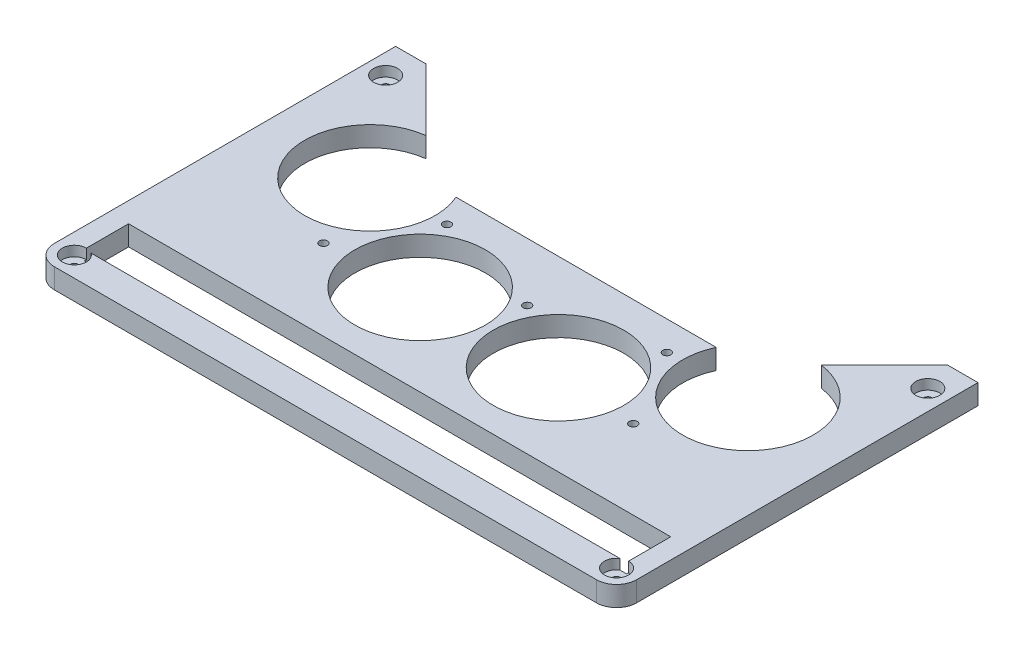
ISO-10303-21;
HEADER;
FILE_DESCRIPTION(('STEP AP214'),'2;1');
FILE_NAME('part.step','',(''),(''),'','','');
FILE_SCHEMA(('AUTOMOTIVE_DESIGN { 1 0 10303 214 1 1 1 1 }'));
ENDSEC;
DATA;
#1=APPLICATION_CONTEXT('core data for automotive mechanical design processes');
#2=APPLICATION_PROTOCOL_DEFINITION('international standard','automotive_design',2000,#1);
#3=PRODUCT_CONTEXT('',#1,'mechanical');
#4=PRODUCT('Part','Part','',(#3));
#5=PRODUCT_RELATED_PRODUCT_CATEGORY('part','',(#4));
#6=PRODUCT_DEFINITION_FORMATION('','',#4);
#7=PRODUCT_DEFINITION_CONTEXT('part definition',#1,'design');
#8=PRODUCT_DEFINITION('design','',#6,#7);
#9=PRODUCT_DEFINITION_SHAPE('','',#8);
#10=(LENGTH_UNIT() NAMED_UNIT(*) SI_UNIT(.MILLI.,.METRE.));
#11=(NAMED_UNIT(*) PLANE_ANGLE_UNIT() SI_UNIT($,.RADIAN.));
#12=(NAMED_UNIT(*) SI_UNIT($,.STERADIAN.) SOLID_ANGLE_UNIT());
#13=UNCERTAINTY_MEASURE_WITH_UNIT(LENGTH_MEASURE(1.E-05),#10,'distance_accuracy_value','');
#14=(GEOMETRIC_REPRESENTATION_CONTEXT(3) GLOBAL_UNCERTAINTY_ASSIGNED_CONTEXT((#13)) GLOBAL_UNIT_ASSIGNED_CONTEXT((#10,
#11,#12)) REPRESENTATION_CONTEXT('',''));
#15=CARTESIAN_POINT('',(0.,0.,0.));
#16=DIRECTION('',(0.,0.,1.));
#17=DIRECTION('',(1.,0.,0.));
#18=AXIS2_PLACEMENT_3D('',#15,#16,#17);
#19=CARTESIAN_POINT('',(10.,0.,-10.));
#20=DIRECTION('',(0.,1.,0.));
#21=DIRECTION('',(0.,0.,1.));
#22=AXIS2_PLACEMENT_3D('',#19,#20,#21);
#23=CYLINDRICAL_SURFACE('',#22,2.);
#24=CARTESIAN_POINT('',(10.,0.,-10.));
#25=DIRECTION('',(0.,1.,0.));
#26=DIRECTION('',(0.,0.,1.));
#27=AXIS2_PLACEMENT_3D('',#24,#25,#26);
#28=CIRCLE('',#27,2.);
#29=CARTESIAN_POINT('',(10.,0.,-8.));
#30=VERTEX_POINT('',#29);
#31=EDGE_CURVE('E281',#30,#30,#28,.T.);
#32=ORIENTED_EDGE('',*,*,#31,.F.);
#33=EDGE_LOOP('',(#32));
#34=FACE_BOUND('',#33,.T.);
#35=CARTESIAN_POINT('',(10.,5.,-10.));
#36=DIRECTION('',(0.,1.,0.));
#37=DIRECTION('',(0.,0.,1.));
#38=AXIS2_PLACEMENT_3D('',#35,#36,#37);
#39=CIRCLE('',#38,2.);
#40=CARTESIAN_POINT('',(10.,5.,-8.));
#41=VERTEX_POINT('',#40);
#42=EDGE_CURVE('E375',#41,#41,#39,.F.);
#43=ORIENTED_EDGE('',*,*,#42,.F.);
#44=EDGE_LOOP('',(#43));
#45=FACE_BOUND('',#44,.T.);
#46=ADVANCED_FACE('F33',(#34,#45),#23,.F.);
#47=CARTESIAN_POINT('',(280.,0.,-10.));
#48=DIRECTION('',(0.,1.,0.));
#49=DIRECTION('',(0.,0.,1.));
#50=AXIS2_PLACEMENT_3D('',#47,#48,#49);
#51=CYLINDRICAL_SURFACE('',#50,2.);
#52=CARTESIAN_POINT('',(280.,0.,-10.));
#53=DIRECTION('',(0.,1.,0.));
#54=DIRECTION('',(0.,0.,-1.));
#55=AXIS2_PLACEMENT_3D('',#52,#53,#54);
#56=CIRCLE('',#55,2.);
#57=CARTESIAN_POINT('',(280.,0.,-12.));
#58=VERTEX_POINT('',#57);
#59=EDGE_CURVE('E278',#58,#58,#56,.T.);
#60=ORIENTED_EDGE('',*,*,#59,.F.);
#61=EDGE_LOOP('',(#60));
#62=FACE_BOUND('',#61,.T.);
#63=CARTESIAN_POINT('',(280.,5.,-10.));
#64=DIRECTION('',(0.,1.,0.));
#65=DIRECTION('',(0.,0.,1.));
#66=AXIS2_PLACEMENT_3D('',#63,#64,#65);
#67=CIRCLE('',#66,2.);
#68=CARTESIAN_POINT('',(280.,5.,-8.));
#69=VERTEX_POINT('',#68);
#70=EDGE_CURVE('E729',#69,#69,#67,.F.);
#71=ORIENTED_EDGE('',*,*,#70,.F.);
#72=EDGE_LOOP('',(#71));
#73=FACE_BOUND('',#72,.T.);
#74=ADVANCED_FACE('F410',(#62,#73),#51,.F.);
#75=CARTESIAN_POINT('',(280.,0.,-165.));
#76=DIRECTION('',(0.,1.,0.));
#77=DIRECTION('',(0.,0.,1.));
#78=AXIS2_PLACEMENT_3D('',#75,#76,#77);
#79=CYLINDRICAL_SURFACE('',#78,2.);
#80=CARTESIAN_POINT('',(280.,0.,-165.));
#81=DIRECTION('',(0.,1.,0.));
#82=DIRECTION('',(0.,0.,-1.));
#83=AXIS2_PLACEMENT_3D('',#80,#81,#82);
#84=CIRCLE('',#83,2.);
#85=CARTESIAN_POINT('',(280.,0.,-167.));
#86=VERTEX_POINT('',#85);
#87=EDGE_CURVE('E358',#86,#86,#84,.T.);
#88=ORIENTED_EDGE('',*,*,#87,.F.);
#89=EDGE_LOOP('',(#88));
#90=FACE_BOUND('',#89,.T.);
#91=CARTESIAN_POINT('',(280.,5.,-165.));
#92=DIRECTION('',(0.,1.,0.));
#93=DIRECTION('',(0.,0.,1.));
#94=AXIS2_PLACEMENT_3D('',#91,#92,#93);
#95=CIRCLE('',#94,2.);
#96=CARTESIAN_POINT('',(280.,5.,-163.));
#97=VERTEX_POINT('',#96);
#98=EDGE_CURVE('E360',#97,#97,#95,.F.);
#99=ORIENTED_EDGE('',*,*,#98,.F.);
#100=EDGE_LOOP('',(#99));
#101=FACE_BOUND('',#100,.T.);
#102=ADVANCED_FACE('F416',(#90,#101),#79,.F.);
#103=CARTESIAN_POINT('',(10.,0.,-165.));
#104=DIRECTION('',(0.,1.,0.));
#105=DIRECTION('',(0.,0.,1.));
#106=AXIS2_PLACEMENT_3D('',#103,#104,#105);
#107=CYLINDRICAL_SURFACE('',#106,2.);
#108=CARTESIAN_POINT('',(10.,0.,-165.));
#109=DIRECTION('',(0.,1.,0.));
#110=DIRECTION('',(0.,0.,1.));
#111=AXIS2_PLACEMENT_3D('',#108,#109,#110);
#112=CIRCLE('',#111,2.);
#113=CARTESIAN_POINT('',(10.,0.,-163.));
#114=VERTEX_POINT('',#113);
#115=EDGE_CURVE('E196',#114,#114,#112,.T.);
#116=ORIENTED_EDGE('',*,*,#115,.F.);
#117=EDGE_LOOP('',(#116));
#118=FACE_BOUND('',#117,.T.);
#119=CARTESIAN_POINT('',(10.,5.,-165.));
#120=DIRECTION('',(0.,1.,0.));
#121=DIRECTION('',(0.,0.,1.));
#122=AXIS2_PLACEMENT_3D('',#119,#120,#121);
#123=CIRCLE('',#122,2.);
#124=CARTESIAN_POINT('',(10.,5.,-163.));
#125=VERTEX_POINT('',#124);
#126=EDGE_CURVE('E355',#125,#125,#123,.F.);
#127=ORIENTED_EDGE('',*,*,#126,.F.);
#128=EDGE_LOOP('',(#127));
#129=FACE_BOUND('',#128,.T.);
#130=ADVANCED_FACE('F460',(#118,#129),#107,.F.);
#131=CARTESIAN_POINT('',(0.,10.,0.));
#132=DIRECTION('',(1.,0.,0.));
#133=DIRECTION('',(0.,0.,-1.));
#134=AXIS2_PLACEMENT_3D('',#131,#132,#133);
#135=PLANE('',#134);
#136=DIRECTION('',(0.,0.,1.));
#137=VECTOR('',#136,1.);
#138=CARTESIAN_POINT('',(0.,0.,0.));
#139=LINE('',#138,#137);
#140=CARTESIAN_POINT('',(0.,0.,-180.));
#141=VERTEX_POINT('',#140);
#142=CARTESIAN_POINT('',(0.,0.,-10.));
#143=VERTEX_POINT('',#142);
#144=EDGE_CURVE('E284',#141,#143,#139,.T.);
#145=ORIENTED_EDGE('',*,*,#144,.T.);
#146=DIRECTION('',(0.,-1.,0.));
#147=VECTOR('',#146,1.);
#148=CARTESIAN_POINT('',(0.,10.,-10.));
#149=LINE('',#148,#147);
#150=CARTESIAN_POINT('',(0.,10.,-10.));
#151=VERTEX_POINT('',#150);
#152=EDGE_CURVE('E345',#143,#151,#149,.F.);
#153=ORIENTED_EDGE('',*,*,#152,.T.);
#154=DIRECTION('',(0.,0.,1.));
#155=VECTOR('',#154,1.);
#156=CARTESIAN_POINT('',(0.,10.,0.));
#157=LINE('',#156,#155);
#158=CARTESIAN_POINT('',(0.,10.,-180.));
#159=VERTEX_POINT('',#158);
#160=EDGE_CURVE('E285',#159,#151,#157,.T.);
#161=ORIENTED_EDGE('',*,*,#160,.F.);
#162=DIRECTION('',(0.,-1.,0.));
#163=VECTOR('',#162,1.);
#164=CARTESIAN_POINT('',(0.,10.,-180.));
#165=LINE('',#164,#163);
#166=EDGE_CURVE('E306',#159,#141,#165,.T.);
#167=ORIENTED_EDGE('',*,*,#166,.T.);
#168=EDGE_LOOP('',(#145,#153,#161,#167));
#169=FACE_BOUND('',#168,.T.);
#170=ADVANCED_FACE('F457',(#169),#135,.F.);
#171=CARTESIAN_POINT('',(0.,10.,0.));
#172=DIRECTION('',(0.,0.,-1.));
#173=DIRECTION('',(-1.,0.,0.));
#174=AXIS2_PLACEMENT_3D('',#171,#172,#173);
#175=PLANE('',#174);
#176=DIRECTION('',(1.,0.,0.));
#177=VECTOR('',#176,1.);
#178=CARTESIAN_POINT('',(0.,10.,0.));
#179=LINE('',#178,#177);
#180=CARTESIAN_POINT('',(10.,10.,0.));
#181=VERTEX_POINT('',#180);
#182=CARTESIAN_POINT('',(280.,10.,0.));
#183=VERTEX_POINT('',#182);
#184=EDGE_CURVE('E288',#181,#183,#179,.T.);
#185=ORIENTED_EDGE('',*,*,#184,.F.);
#186=DIRECTION('',(0.,-1.,0.));
#187=VECTOR('',#186,1.);
#188=CARTESIAN_POINT('',(10.,10.,0.));
#189=LINE('',#188,#187);
#190=CARTESIAN_POINT('',(10.,0.,0.));
#191=VERTEX_POINT('',#190);
#192=EDGE_CURVE('E338',#181,#191,#189,.T.);
#193=ORIENTED_EDGE('',*,*,#192,.T.);
#194=DIRECTION('',(1.,0.,0.));
#195=VECTOR('',#194,1.);
#196=CARTESIAN_POINT('',(0.,0.,0.));
#197=LINE('',#196,#195);
#198=CARTESIAN_POINT('',(280.,0.,0.));
#199=VERTEX_POINT('',#198);
#200=EDGE_CURVE('E309',#191,#199,#197,.T.);
#201=ORIENTED_EDGE('',*,*,#200,.T.);
#202=DIRECTION('',(0.,-1.,0.));
#203=VECTOR('',#202,1.);
#204=CARTESIAN_POINT('',(280.,10.,0.));
#205=LINE('',#204,#203);
#206=EDGE_CURVE('E336',#199,#183,#205,.F.);
#207=ORIENTED_EDGE('',*,*,#206,.T.);
#208=EDGE_LOOP('',(#185,#193,#201,#207));
#209=FACE_BOUND('',#208,.T.);
#210=ADVANCED_FACE('F453',(#209),#175,.F.);
#211=CARTESIAN_POINT('',(290.,10.,0.));
#212=DIRECTION('',(-1.,0.,0.));
#213=DIRECTION('',(0.,0.,1.));
#214=AXIS2_PLACEMENT_3D('',#211,#212,#213);
#215=PLANE('',#214);
#216=DIRECTION('',(0.,0.,-1.));
#217=VECTOR('',#216,1.);
#218=CARTESIAN_POINT('',(290.,10.,0.));
#219=LINE('',#218,#217);
#220=CARTESIAN_POINT('',(290.,10.,-10.));
#221=VERTEX_POINT('',#220);
#222=CARTESIAN_POINT('',(290.,10.,-180.));
#223=VERTEX_POINT('',#222);
#224=EDGE_CURVE('E292',#221,#223,#219,.T.);
#225=ORIENTED_EDGE('',*,*,#224,.F.);
#226=DIRECTION('',(0.,-1.,0.));
#227=VECTOR('',#226,1.);
#228=CARTESIAN_POINT('',(290.,10.,-10.));
#229=LINE('',#228,#227);
#230=CARTESIAN_POINT('',(290.,0.,-10.));
#231=VERTEX_POINT('',#230);
#232=EDGE_CURVE('E351',#221,#231,#229,.T.);
#233=ORIENTED_EDGE('',*,*,#232,.T.);
#234=DIRECTION('',(0.,0.,-1.));
#235=VECTOR('',#234,1.);
#236=CARTESIAN_POINT('',(290.,0.,0.));
#237=LINE('',#236,#235);
#238=CARTESIAN_POINT('',(290.,0.,-180.));
#239=VERTEX_POINT('',#238);
#240=EDGE_CURVE('E312',#231,#239,#237,.T.);
#241=ORIENTED_EDGE('',*,*,#240,.T.);
#242=DIRECTION('',(0.,-1.,0.));
#243=VECTOR('',#242,1.);
#244=CARTESIAN_POINT('',(290.,10.,-180.));
#245=LINE('',#244,#243);
#246=EDGE_CURVE('E333',#223,#239,#245,.T.);
#247=ORIENTED_EDGE('',*,*,#246,.F.);
#248=EDGE_LOOP('',(#225,#233,#241,#247));
#249=FACE_BOUND('',#248,.T.);
#250=ADVANCED_FACE('F449',(#249),#215,.F.);
#251=CARTESIAN_POINT('',(290.,10.,-180.));
#252=DIRECTION('',(0.,0.,1.));
#253=DIRECTION('',(1.,0.,0.));
#254=AXIS2_PLACEMENT_3D('',#251,#252,#253);
#255=PLANE('',#254);
#256=DIRECTION('',(-1.,0.,0.));
#257=VECTOR('',#256,1.);
#258=CARTESIAN_POINT('',(290.,0.,-180.));
#259=LINE('',#258,#257);
#260=CARTESIAN_POINT('',(275.,0.,-180.));
#261=VERTEX_POINT('',#260);
#262=EDGE_CURVE('E314',#239,#261,#259,.T.);
#263=ORIENTED_EDGE('',*,*,#262,.T.);
#264=DIRECTION('',(0.,-1.,0.));
#265=VECTOR('',#264,1.);
#266=CARTESIAN_POINT('',(275.,10.,-180.));
#267=LINE('',#266,#265);
#268=CARTESIAN_POINT('',(275.,10.,-180.));
#269=VERTEX_POINT('',#268);
#270=EDGE_CURVE('E330',#269,#261,#267,.T.);
#271=ORIENTED_EDGE('',*,*,#270,.F.);
#272=DIRECTION('',(-1.,0.,0.));
#273=VECTOR('',#272,1.);
#274=CARTESIAN_POINT('',(290.,10.,-180.));
#275=LINE('',#274,#273);
#276=EDGE_CURVE('E294',#223,#269,#275,.T.);
#277=ORIENTED_EDGE('',*,*,#276,.F.);
#278=ORIENTED_EDGE('',*,*,#246,.T.);
#279=EDGE_LOOP('',(#263,#271,#277,#278));
#280=FACE_BOUND('',#279,.T.);
#281=ADVANCED_FACE('F445',(#280),#255,.F.);
#282=CARTESIAN_POINT('',(275.,10.,-180.));
#283=DIRECTION('',(0.707106781186549,0.,0.707106781186546));
#284=DIRECTION('',(0.707106781186546,0.,-0.707106781186549));
#285=AXIS2_PLACEMENT_3D('',#282,#283,#284);
#286=PLANE('',#285);
#287=DIRECTION('',(-0.707106781186546,0.,0.707106781186549));
#288=VECTOR('',#287,1.);
#289=CARTESIAN_POINT('',(275.,0.,-180.));
#290=LINE('',#289,#288);
#291=CARTESIAN_POINT('',(243.509947245319,0.,-148.509947245319));
#292=VERTEX_POINT('',#291);
#293=EDGE_CURVE('E316',#261,#292,#290,.T.);
#294=ORIENTED_EDGE('',*,*,#293,.T.);
#295=DIRECTION('',(0.,-1.,0.));
#296=VECTOR('',#295,1.);
#297=CARTESIAN_POINT('',(243.509947245319,10.,-148.509947245319));
#298=LINE('',#297,#296);
#299=CARTESIAN_POINT('',(243.509947245319,10.,-148.509947245319));
#300=VERTEX_POINT('',#299);
#301=EDGE_CURVE('E275',#292,#300,#298,.F.);
#302=ORIENTED_EDGE('',*,*,#301,.T.);
#303=DIRECTION('',(-0.707106781186546,0.,0.707106781186549));
#304=VECTOR('',#303,1.);
#305=CARTESIAN_POINT('',(275.,10.,-180.));
#306=LINE('',#305,#304);
#307=EDGE_CURVE('E296',#269,#300,#306,.T.);
#308=ORIENTED_EDGE('',*,*,#307,.F.);
#309=ORIENTED_EDGE('',*,*,#270,.T.);
#310=EDGE_LOOP('',(#294,#302,#308,#309));
#311=FACE_BOUND('',#310,.T.);
#312=ADVANCED_FACE('F441',(#311),#286,.F.);
#313=CARTESIAN_POINT('',(64.9999999999998,10.,-130.));
#314=DIRECTION('',(0.,0.,1.));
#315=DIRECTION('',(1.,0.,0.));
#316=AXIS2_PLACEMENT_3D('',#313,#314,#315);
#317=PLANE('',#316);
#318=DIRECTION('',(-1.,0.,0.));
#319=VECTOR('',#318,1.);
#320=CARTESIAN_POINT('',(64.9999999999998,0.,-130.));
#321=LINE('',#320,#319);
#322=CARTESIAN_POINT('',(209.63044313344,0.,-130.));
#323=VERTEX_POINT('',#322);
#324=CARTESIAN_POINT('',(80.0498040437955,0.,-130.));
#325=VERTEX_POINT('',#324);
#326=EDGE_CURVE('E319',#323,#325,#321,.T.);
#327=ORIENTED_EDGE('',*,*,#326,.T.);
#328=DIRECTION('',(0.,-1.,0.));
#329=VECTOR('',#328,1.);
#330=CARTESIAN_POINT('',(80.0498040437955,10.,-130.));
#331=LINE('',#330,#329);
#332=CARTESIAN_POINT('',(80.0498040437955,10.,-130.));
#333=VERTEX_POINT('',#332);
#334=EDGE_CURVE('E252',#325,#333,#331,.F.);
#335=ORIENTED_EDGE('',*,*,#334,.T.);
#336=DIRECTION('',(-1.,0.,0.));
#337=VECTOR('',#336,1.);
#338=CARTESIAN_POINT('',(64.9999999999998,10.,-130.));
#339=LINE('',#338,#337);
#340=CARTESIAN_POINT('',(209.63044313344,10.,-130.));
#341=VERTEX_POINT('',#340);
#342=EDGE_CURVE('E299',#341,#333,#339,.T.);
#343=ORIENTED_EDGE('',*,*,#342,.F.);
#344=DIRECTION('',(0.,-1.,0.));
#345=VECTOR('',#344,1.);
#346=CARTESIAN_POINT('',(209.63044313344,10.,-130.));
#347=LINE('',#346,#345);
#348=EDGE_CURVE('E271',#341,#323,#347,.T.);
#349=ORIENTED_EDGE('',*,*,#348,.T.);
#350=EDGE_LOOP('',(#327,#335,#343,#349));
#351=FACE_BOUND('',#350,.T.);
#352=ADVANCED_FACE('F437',(#351),#317,.F.);
#353=CARTESIAN_POINT('',(15.,10.,-180.));
#354=DIRECTION('',(-0.707106781186549,0.,0.707106781186546));
#355=DIRECTION('',(0.707106781186546,0.,0.707106781186549));
#356=AXIS2_PLACEMENT_3D('',#353,#354,#355);
#357=PLANE('',#356);
#358=DIRECTION('',(-0.707106781186546,0.,-0.707106781186549));
#359=VECTOR('',#358,1.);
#360=CARTESIAN_POINT('',(15.,10.,-180.));
#361=LINE('',#360,#359);
#362=CARTESIAN_POINT('',(45.9060044445982,10.,-149.093995555402));
#363=VERTEX_POINT('',#362);
#364=CARTESIAN_POINT('',(15.,10.,-180.));
#365=VERTEX_POINT('',#364);
#366=EDGE_CURVE('E302',#363,#365,#361,.T.);
#367=ORIENTED_EDGE('',*,*,#366,.F.);
#368=DIRECTION('',(0.,-1.,0.));
#369=VECTOR('',#368,1.);
#370=CARTESIAN_POINT('',(45.9060044445982,10.,-149.093995555402));
#371=LINE('',#370,#369);
#372=CARTESIAN_POINT('',(45.9060044445982,0.,-149.093995555402));
#373=VERTEX_POINT('',#372);
#374=EDGE_CURVE('E248',#363,#373,#371,.T.);
#375=ORIENTED_EDGE('',*,*,#374,.T.);
#376=DIRECTION('',(-0.707106781186546,0.,-0.707106781186549));
#377=VECTOR('',#376,1.);
#378=CARTESIAN_POINT('',(15.,0.,-180.));
#379=LINE('',#378,#377);
#380=CARTESIAN_POINT('',(15.,0.,-180.));
#381=VERTEX_POINT('',#380);
#382=EDGE_CURVE('E322',#373,#381,#379,.T.);
#383=ORIENTED_EDGE('',*,*,#382,.T.);
#384=DIRECTION('',(0.,-1.,0.));
#385=VECTOR('',#384,1.);
#386=CARTESIAN_POINT('',(15.,10.,-180.));
#387=LINE('',#386,#385);
#388=EDGE_CURVE('E327',#365,#381,#387,.T.);
#389=ORIENTED_EDGE('',*,*,#388,.F.);
#390=EDGE_LOOP('',(#367,#375,#383,#389));
#391=FACE_BOUND('',#390,.T.);
#392=ADVANCED_FACE('F433',(#391),#357,.F.);
#393=CARTESIAN_POINT('',(0.,10.,-180.));
#394=DIRECTION('',(0.,0.,1.));
#395=DIRECTION('',(1.,0.,0.));
#396=AXIS2_PLACEMENT_3D('',#393,#394,#395);
#397=PLANE('',#396);
#398=DIRECTION('',(-1.,0.,0.));
#399=VECTOR('',#398,1.);
#400=CARTESIAN_POINT('',(0.,0.,-180.));
#401=LINE('',#400,#399);
#402=EDGE_CURVE('E289',#381,#141,#401,.T.);
#403=ORIENTED_EDGE('',*,*,#402,.T.);
#404=ORIENTED_EDGE('',*,*,#166,.F.);
#405=DIRECTION('',(-1.,0.,0.));
#406=VECTOR('',#405,1.);
#407=CARTESIAN_POINT('',(0.,10.,-180.));
#408=LINE('',#407,#406);
#409=EDGE_CURVE('E304',#365,#159,#408,.T.);
#410=ORIENTED_EDGE('',*,*,#409,.F.);
#411=ORIENTED_EDGE('',*,*,#388,.T.);
#412=EDGE_LOOP('',(#403,#404,#410,#411));
#413=FACE_BOUND('',#412,.T.);
#414=ADVANCED_FACE('F425',(#413),#397,.F.);
#415=CARTESIAN_POINT('',(0.,10.,0.));
#416=DIRECTION('',(0.,-1.,0.));
#417=DIRECTION('',(0.,0.,-1.));
#418=AXIS2_PLACEMENT_3D('',#415,#416,#417);
#419=PLANE('',#418);
#420=CARTESIAN_POINT('',(280.,10.,-165.));
#421=DIRECTION('',(0.,1.,0.));
#422=DIRECTION('',(0.,0.,1.));
#423=AXIS2_PLACEMENT_3D('',#420,#421,#422);
#424=CIRCLE('',#423,5.99999999999999);
#425=CARTESIAN_POINT('',(280.,10.,-159.));
#426=VERTEX_POINT('',#425);
#427=EDGE_CURVE('E733',#426,#426,#424,.T.);
#428=ORIENTED_EDGE('',*,*,#427,.F.);
#429=EDGE_LOOP('',(#428));
#430=FACE_BOUND('',#429,.T.);
#431=CARTESIAN_POINT('',(10.,10.,-165.));
#432=DIRECTION('',(0.,1.,0.));
#433=DIRECTION('',(0.,0.,1.));
#434=AXIS2_PLACEMENT_3D('',#431,#432,#433);
#435=CIRCLE('',#434,6.);
#436=CARTESIAN_POINT('',(10.,10.,-159.));
#437=VERTEX_POINT('',#436);
#438=EDGE_CURVE('E363',#437,#437,#435,.T.);
#439=ORIENTED_EDGE('',*,*,#438,.F.);
#440=EDGE_LOOP('',(#439));
#441=FACE_BOUND('',#440,.T.);
#442=DIRECTION('',(1.,0.,0.));
#443=VECTOR('',#442,1.);
#444=CARTESIAN_POINT('',(9.99999999999998,10.,-15.));
#445=LINE('',#444,#443);
#446=CARTESIAN_POINT('',(13.3166247903554,10.,-15.));
#447=VERTEX_POINT('',#446);
#448=CARTESIAN_POINT('',(276.683375209645,10.,-15.));
#449=VERTEX_POINT('',#448);
#450=EDGE_CURVE('E183',#447,#449,#445,.T.);
#451=ORIENTED_EDGE('',*,*,#450,.F.);
#452=CARTESIAN_POINT('',(10.,10.,-10.));
#453=DIRECTION('',(0.,1.,0.));
#454=DIRECTION('',(0.,0.,1.));
#455=AXIS2_PLACEMENT_3D('',#452,#453,#454);
#456=CIRCLE('',#455,6.);
#457=CARTESIAN_POINT('',(9.99999999999998,10.,-16.));
#458=VERTEX_POINT('',#457);
#459=EDGE_CURVE('E170',#458,#447,#456,.T.);
#460=ORIENTED_EDGE('',*,*,#459,.F.);
#461=DIRECTION('',(0.,0.,1.));
#462=VECTOR('',#461,1.);
#463=CARTESIAN_POINT('',(9.99999999999998,10.,-37.));
#464=LINE('',#463,#462);
#465=CARTESIAN_POINT('',(9.99999999999998,10.,-37.));
#466=VERTEX_POINT('',#465);
#467=EDGE_CURVE('E192',#466,#458,#464,.T.);
#468=ORIENTED_EDGE('',*,*,#467,.F.);
#469=DIRECTION('',(-1.,0.,0.));
#470=VECTOR('',#469,1.);
#471=CARTESIAN_POINT('',(9.99999999999998,10.,-37.));
#472=LINE('',#471,#470);
#473=CARTESIAN_POINT('',(280.,10.,-37.));
#474=VERTEX_POINT('',#473);
#475=EDGE_CURVE('E194',#474,#466,#472,.T.);
#476=ORIENTED_EDGE('',*,*,#475,.F.);
#477=DIRECTION('',(0.,0.,-1.));
#478=VECTOR('',#477,1.);
#479=CARTESIAN_POINT('',(280.,10.,-37.));
#480=LINE('',#479,#478);
#481=CARTESIAN_POINT('',(280.,10.,-16.));
#482=VERTEX_POINT('',#481);
#483=EDGE_CURVE('E191',#482,#474,#480,.T.);
#484=ORIENTED_EDGE('',*,*,#483,.F.);
#485=CARTESIAN_POINT('',(280.,10.,-10.));
#486=DIRECTION('',(0.,1.,0.));
#487=DIRECTION('',(0.,0.,1.));
#488=AXIS2_PLACEMENT_3D('',#485,#486,#487);
#489=CIRCLE('',#488,5.99999999999999);
#490=EDGE_CURVE('E190',#449,#482,#489,.T.);
#491=ORIENTED_EDGE('',*,*,#490,.F.);
#492=EDGE_LOOP('',(#451,#460,#468,#476,#484,#491));
#493=FACE_BOUND('',#492,.T.);
#494=CARTESIAN_POINT('',(89.5724799318912,10.,-115.985316823688));
#495=DIRECTION('',(0.,-1.,0.));
#496=DIRECTION('',(0.,0.,-1.));
#497=AXIS2_PLACEMENT_3D('',#494,#495,#496);
#498=CIRCLE('',#497,2.);
#499=CARTESIAN_POINT('',(89.5724799318912,10.,-117.985316823688));
#500=VERTEX_POINT('',#499);
#501=EDGE_CURVE('E215',#500,#500,#498,.T.);
#502=ORIENTED_EDGE('',*,*,#501,.T.);
#503=EDGE_LOOP('',(#502));
#504=FACE_BOUND('',#503,.T.);
#505=CARTESIAN_POINT('',(66.8975853585768,10.,-77.115673706095));
#506=DIRECTION('',(0.,-1.,0.));
#507=DIRECTION('',(0.,0.,-1.));
#508=AXIS2_PLACEMENT_3D('',#505,#506,#507);
#509=CIRCLE('',#508,1.99999999999965);
#510=CARTESIAN_POINT('',(66.8975853585768,10.,-79.1156737060946));
#511=VERTEX_POINT('',#510);
#512=EDGE_CURVE('E221',#511,#511,#509,.T.);
#513=ORIENTED_EDGE('',*,*,#512,.T.);
#514=EDGE_LOOP('',(#513));
#515=FACE_BOUND('',#514,.T.);
#516=CARTESIAN_POINT('',(221.896020418396,10.,-76.4191616766688));
#517=DIRECTION('',(0.,-1.,0.));
#518=DIRECTION('',(0.,0.,-1.));
#519=AXIS2_PLACEMENT_3D('',#516,#517,#518);
#520=CIRCLE('',#519,2.);
#521=CARTESIAN_POINT('',(221.896020418396,10.,-78.4191616766688));
#522=VERTEX_POINT('',#521);
#523=EDGE_CURVE('E227',#522,#522,#520,.T.);
#524=ORIENTED_EDGE('',*,*,#523,.T.);
#525=EDGE_LOOP('',(#524));
#526=FACE_BOUND('',#525,.T.);
#527=CARTESIAN_POINT('',(199.571369329182,10.,-115.49101796409));
#528=DIRECTION('',(0.,-1.,0.));
#529=DIRECTION('',(0.,0.,-1.));
#530=AXIS2_PLACEMENT_3D('',#527,#528,#529);
#531=CIRCLE('',#530,2.);
#532=CARTESIAN_POINT('',(199.571369329182,10.,-117.49101796409));
#533=VERTEX_POINT('',#532);
#534=EDGE_CURVE('E233',#533,#533,#531,.T.);
#535=ORIENTED_EDGE('',*,*,#534,.T.);
#536=EDGE_LOOP('',(#535));
#537=FACE_BOUND('',#536,.T.);
#538=CARTESIAN_POINT('',(144.505701140412,10.,-101.001110602726));
#539=DIRECTION('',(0.,-1.,0.));
#540=DIRECTION('',(0.,0.,-1.));
#541=AXIS2_PLACEMENT_3D('',#538,#539,#540);
#542=CIRCLE('',#541,2.);
#543=CARTESIAN_POINT('',(144.505701140412,10.,-103.001110602726));
#544=VERTEX_POINT('',#543);
#545=EDGE_CURVE('E239',#544,#544,#542,.T.);
#546=ORIENTED_EDGE('',*,*,#545,.T.);
#547=EDGE_LOOP('',(#546));
#548=FACE_BOUND('',#547,.T.);
#549=CARTESIAN_POINT('',(110.048910395228,10.,-82.1564074723037));
#550=DIRECTION('',(0.,-1.,0.));
#551=DIRECTION('',(0.,0.,-1.));
#552=AXIS2_PLACEMENT_3D('',#549,#550,#551);
#553=CIRCLE('',#552,32.5);
#554=CARTESIAN_POINT('',(110.048910395228,10.,-114.656407472304));
#555=VERTEX_POINT('',#554);
#556=EDGE_CURVE('E256',#555,#555,#553,.T.);
#557=ORIENTED_EDGE('',*,*,#556,.T.);
#558=EDGE_LOOP('',(#557));
#559=FACE_BOUND('',#558,.T.);
#560=CARTESIAN_POINT('',(179.153264776159,10.,-81.9426309537752));
#561=DIRECTION('',(0.,-1.,0.));
#562=DIRECTION('',(0.,0.,-1.));
#563=AXIS2_PLACEMENT_3D('',#560,#561,#562);
#564=CIRCLE('',#563,32.5);
#565=CARTESIAN_POINT('',(179.153264776159,10.,-114.442630953775));
#566=VERTEX_POINT('',#565);
#567=EDGE_CURVE('E262',#566,#566,#564,.T.);
#568=ORIENTED_EDGE('',*,*,#567,.T.);
#569=EDGE_LOOP('',(#568));
#570=FACE_BOUND('',#569,.T.);
#571=ORIENTED_EDGE('',*,*,#342,.T.);
#572=CARTESIAN_POINT('',(50.309672248483,10.,-116.893720558547));
#573=DIRECTION('',(0.,-1.,0.));
#574=DIRECTION('',(0.,0.,-1.));
#575=AXIS2_PLACEMENT_3D('',#572,#573,#574);
#576=CIRCLE('',#575,32.5);
#577=EDGE_CURVE('E245',#333,#363,#576,.T.);
#578=ORIENTED_EDGE('',*,*,#577,.T.);
#579=ORIENTED_EDGE('',*,*,#366,.T.);
#580=ORIENTED_EDGE('',*,*,#409,.T.);
#581=ORIENTED_EDGE('',*,*,#160,.T.);
#582=CARTESIAN_POINT('',(10.,10.,-10.));
#583=DIRECTION('',(0.,-1.,0.));
#584=DIRECTION('',(0.,0.,-1.));
#585=AXIS2_PLACEMENT_3D('',#582,#583,#584);
#586=CIRCLE('',#585,10.);
#587=EDGE_CURVE('E349',#151,#181,#586,.F.);
#588=ORIENTED_EDGE('',*,*,#587,.T.);
#589=ORIENTED_EDGE('',*,*,#184,.T.);
#590=CARTESIAN_POINT('',(280.,10.,-10.));
#591=DIRECTION('',(0.,-1.,0.));
#592=DIRECTION('',(0.,0.,-1.));
#593=AXIS2_PLACEMENT_3D('',#590,#591,#592);
#594=CIRCLE('',#593,10.);
#595=EDGE_CURVE('E347',#183,#221,#594,.F.);
#596=ORIENTED_EDGE('',*,*,#595,.T.);
#597=ORIENTED_EDGE('',*,*,#224,.T.);
#598=ORIENTED_EDGE('',*,*,#276,.T.);
#599=ORIENTED_EDGE('',*,*,#307,.T.);
#600=CARTESIAN_POINT('',(239.106279441433,10.,-116.309672248465));
#601=DIRECTION('',(0.,-1.,0.));
#602=DIRECTION('',(0.,0.,-1.));
#603=AXIS2_PLACEMENT_3D('',#600,#601,#602);
#604=CIRCLE('',#603,32.5);
#605=EDGE_CURVE('E268',#300,#341,#604,.T.);
#606=ORIENTED_EDGE('',*,*,#605,.T.);
#607=EDGE_LOOP('',(#571,#578,#579,#580,#581,#588,#589,#596,#597,#598,#599,#606));
#608=FACE_BOUND('',#607,.T.);
#609=ADVANCED_FACE('F187',(#430,#441,#493,#504,#515,#526,#537,#548,#559,#570,#608),#419,.F.);
#610=CARTESIAN_POINT('',(0.,0.,0.));
#611=DIRECTION('',(0.,-1.,0.));
#612=DIRECTION('',(0.,0.,-1.));
#613=AXIS2_PLACEMENT_3D('',#610,#611,#612);
#614=PLANE('',#613);
#615=ORIENTED_EDGE('',*,*,#87,.T.);
#616=EDGE_LOOP('',(#615));
#617=FACE_BOUND('',#616,.T.);
#618=ORIENTED_EDGE('',*,*,#115,.T.);
#619=EDGE_LOOP('',(#618));
#620=FACE_BOUND('',#619,.T.);
#621=DIRECTION('',(0.,0.,1.));
#622=VECTOR('',#621,1.);
#623=CARTESIAN_POINT('',(9.99999999999998,0.,-37.));
#624=LINE('',#623,#622);
#625=CARTESIAN_POINT('',(9.99999999999998,0.,-37.));
#626=VERTEX_POINT('',#625);
#627=CARTESIAN_POINT('',(9.99999999999998,0.,-15.));
#628=VERTEX_POINT('',#627);
#629=EDGE_CURVE('E202',#626,#628,#624,.T.);
#630=ORIENTED_EDGE('',*,*,#629,.T.);
#631=DIRECTION('',(1.,0.,0.));
#632=VECTOR('',#631,1.);
#633=CARTESIAN_POINT('',(9.99999999999998,0.,-15.));
#634=LINE('',#633,#632);
#635=CARTESIAN_POINT('',(280.,0.,-15.));
#636=VERTEX_POINT('',#635);
#637=EDGE_CURVE('E379',#628,#636,#634,.T.);
#638=ORIENTED_EDGE('',*,*,#637,.T.);
#639=DIRECTION('',(0.,0.,-1.));
#640=VECTOR('',#639,1.);
#641=CARTESIAN_POINT('',(280.,0.,-37.));
#642=LINE('',#641,#640);
#643=CARTESIAN_POINT('',(280.,0.,-37.));
#644=VERTEX_POINT('',#643);
#645=EDGE_CURVE('E383',#636,#644,#642,.T.);
#646=ORIENTED_EDGE('',*,*,#645,.T.);
#647=DIRECTION('',(-1.,0.,0.));
#648=VECTOR('',#647,1.);
#649=CARTESIAN_POINT('',(9.99999999999998,0.,-37.));
#650=LINE('',#649,#648);
#651=EDGE_CURVE('E214',#644,#626,#650,.T.);
#652=ORIENTED_EDGE('',*,*,#651,.T.);
#653=EDGE_LOOP('',(#630,#638,#646,#652));
#654=FACE_BOUND('',#653,.T.);
#655=CARTESIAN_POINT('',(89.5724799318912,0.,-115.985316823688));
#656=DIRECTION('',(0.,-1.,0.));
#657=DIRECTION('',(0.,0.,-1.));
#658=AXIS2_PLACEMENT_3D('',#655,#656,#657);
#659=CIRCLE('',#658,2.);
#660=CARTESIAN_POINT('',(89.5724799318912,0.,-117.985316823688));
#661=VERTEX_POINT('',#660);
#662=EDGE_CURVE('E205',#661,#661,#659,.T.);
#663=ORIENTED_EDGE('',*,*,#662,.F.);
#664=EDGE_LOOP('',(#663));
#665=FACE_BOUND('',#664,.T.);
#666=CARTESIAN_POINT('',(66.8975853585768,0.,-77.115673706095));
#667=DIRECTION('',(0.,-1.,0.));
#668=DIRECTION('',(0.,0.,-1.));
#669=AXIS2_PLACEMENT_3D('',#666,#667,#668);
#670=CIRCLE('',#669,1.99999999999965);
#671=CARTESIAN_POINT('',(66.8975853585768,0.,-79.1156737060946));
#672=VERTEX_POINT('',#671);
#673=EDGE_CURVE('E218',#672,#672,#670,.T.);
#674=ORIENTED_EDGE('',*,*,#673,.F.);
#675=EDGE_LOOP('',(#674));
#676=FACE_BOUND('',#675,.T.);
#677=CARTESIAN_POINT('',(221.896020418396,0.,-76.4191616766688));
#678=DIRECTION('',(0.,-1.,0.));
#679=DIRECTION('',(0.,0.,-1.));
#680=AXIS2_PLACEMENT_3D('',#677,#678,#679);
#681=CIRCLE('',#680,2.);
#682=CARTESIAN_POINT('',(221.896020418396,0.,-78.4191616766688));
#683=VERTEX_POINT('',#682);
#684=EDGE_CURVE('E224',#683,#683,#681,.T.);
#685=ORIENTED_EDGE('',*,*,#684,.F.);
#686=EDGE_LOOP('',(#685));
#687=FACE_BOUND('',#686,.T.);
#688=CARTESIAN_POINT('',(199.571369329182,0.,-115.49101796409));
#689=DIRECTION('',(0.,-1.,0.));
#690=DIRECTION('',(0.,0.,-1.));
#691=AXIS2_PLACEMENT_3D('',#688,#689,#690);
#692=CIRCLE('',#691,2.);
#693=CARTESIAN_POINT('',(199.571369329182,0.,-117.49101796409));
#694=VERTEX_POINT('',#693);
#695=EDGE_CURVE('E230',#694,#694,#692,.T.);
#696=ORIENTED_EDGE('',*,*,#695,.F.);
#697=EDGE_LOOP('',(#696));
#698=FACE_BOUND('',#697,.T.);
#699=CARTESIAN_POINT('',(144.505701140412,0.,-101.001110602726));
#700=DIRECTION('',(0.,-1.,0.));
#701=DIRECTION('',(0.,0.,-1.));
#702=AXIS2_PLACEMENT_3D('',#699,#700,#701);
#703=CIRCLE('',#702,2.);
#704=CARTESIAN_POINT('',(144.505701140412,0.,-103.001110602726));
#705=VERTEX_POINT('',#704);
#706=EDGE_CURVE('E236',#705,#705,#703,.T.);
#707=ORIENTED_EDGE('',*,*,#706,.F.);
#708=EDGE_LOOP('',(#707));
#709=FACE_BOUND('',#708,.T.);
#710=CARTESIAN_POINT('',(50.309672248483,0.,-116.893720558547));
#711=DIRECTION('',(0.,-1.,0.));
#712=DIRECTION('',(0.,0.,-1.));
#713=AXIS2_PLACEMENT_3D('',#710,#711,#712);
#714=CIRCLE('',#713,32.5);
#715=EDGE_CURVE('E242',#325,#373,#714,.T.);
#716=ORIENTED_EDGE('',*,*,#715,.F.);
#717=ORIENTED_EDGE('',*,*,#326,.F.);
#718=CARTESIAN_POINT('',(239.106279441433,0.,-116.309672248465));
#719=DIRECTION('',(0.,-1.,0.));
#720=DIRECTION('',(0.,0.,-1.));
#721=AXIS2_PLACEMENT_3D('',#718,#719,#720);
#722=CIRCLE('',#721,32.5);
#723=EDGE_CURVE('E265',#292,#323,#722,.T.);
#724=ORIENTED_EDGE('',*,*,#723,.F.);
#725=ORIENTED_EDGE('',*,*,#293,.F.);
#726=ORIENTED_EDGE('',*,*,#262,.F.);
#727=ORIENTED_EDGE('',*,*,#240,.F.);
#728=CARTESIAN_POINT('',(280.,0.,-10.));
#729=DIRECTION('',(0.,-1.,0.));
#730=DIRECTION('',(0.,0.,-1.));
#731=AXIS2_PLACEMENT_3D('',#728,#729,#730);
#732=CIRCLE('',#731,10.);
#733=EDGE_CURVE('E341',#231,#199,#732,.T.);
#734=ORIENTED_EDGE('',*,*,#733,.T.);
#735=ORIENTED_EDGE('',*,*,#200,.F.);
#736=CARTESIAN_POINT('',(10.,0.,-10.));
#737=DIRECTION('',(0.,-1.,0.));
#738=DIRECTION('',(0.,0.,-1.));
#739=AXIS2_PLACEMENT_3D('',#736,#737,#738);
#740=CIRCLE('',#739,10.);
#741=EDGE_CURVE('E343',#191,#143,#740,.T.);
#742=ORIENTED_EDGE('',*,*,#741,.T.);
#743=ORIENTED_EDGE('',*,*,#144,.F.);
#744=ORIENTED_EDGE('',*,*,#402,.F.);
#745=ORIENTED_EDGE('',*,*,#382,.F.);
#746=EDGE_LOOP('',(#716,#717,#724,#725,#726,#727,#734,#735,#742,#743,#744,#745));
#747=FACE_BOUND('',#746,.T.);
#748=CARTESIAN_POINT('',(110.048910395228,0.,-82.1564074723037));
#749=DIRECTION('',(0.,-1.,0.));
#750=DIRECTION('',(0.,0.,-1.));
#751=AXIS2_PLACEMENT_3D('',#748,#749,#750);
#752=CIRCLE('',#751,32.5);
#753=CARTESIAN_POINT('',(110.048910395228,0.,-114.656407472304));
#754=VERTEX_POINT('',#753);
#755=EDGE_CURVE('E255',#754,#754,#752,.T.);
#756=ORIENTED_EDGE('',*,*,#755,.F.);
#757=EDGE_LOOP('',(#756));
#758=FACE_BOUND('',#757,.T.);
#759=CARTESIAN_POINT('',(179.153264776159,0.,-81.9426309537752));
#760=DIRECTION('',(0.,-1.,0.));
#761=DIRECTION('',(0.,0.,-1.));
#762=AXIS2_PLACEMENT_3D('',#759,#760,#761);
#763=CIRCLE('',#762,32.5);
#764=CARTESIAN_POINT('',(179.153264776159,0.,-114.442630953775));
#765=VERTEX_POINT('',#764);
#766=EDGE_CURVE('E259',#765,#765,#763,.T.);
#767=ORIENTED_EDGE('',*,*,#766,.F.);
#768=EDGE_LOOP('',(#767));
#769=FACE_BOUND('',#768,.T.);
#770=ORIENTED_EDGE('',*,*,#59,.T.);
#771=EDGE_LOOP('',(#770));
#772=FACE_BOUND('',#771,.T.);
#773=ORIENTED_EDGE('',*,*,#31,.T.);
#774=EDGE_LOOP('',(#773));
#775=FACE_BOUND('',#774,.T.);
#776=ADVANCED_FACE('F386',(#617,#620,#654,#665,#676,#687,#698,#709,#747,#758,#769,#772,#775),
#614,.T.);
#777=CARTESIAN_POINT('',(10.,10.,-10.));
#778=DIRECTION('',(0.,-1.,0.));
#779=DIRECTION('',(0.,0.,-1.));
#780=AXIS2_PLACEMENT_3D('',#777,#778,#779);
#781=CYLINDRICAL_SURFACE('',#780,10.);
#782=ORIENTED_EDGE('',*,*,#587,.F.);
#783=ORIENTED_EDGE('',*,*,#152,.F.);
#784=ORIENTED_EDGE('',*,*,#741,.F.);
#785=ORIENTED_EDGE('',*,*,#192,.F.);
#786=EDGE_LOOP('',(#782,#783,#784,#785));
#787=FACE_BOUND('',#786,.T.);
#788=ADVANCED_FACE('F429',(#787),#781,.T.);
#789=CARTESIAN_POINT('',(280.,10.,-10.));
#790=DIRECTION('',(0.,-1.,0.));
#791=DIRECTION('',(0.,0.,-1.));
#792=AXIS2_PLACEMENT_3D('',#789,#790,#791);
#793=CYLINDRICAL_SURFACE('',#792,10.);
#794=ORIENTED_EDGE('',*,*,#595,.F.);
#795=ORIENTED_EDGE('',*,*,#206,.F.);
#796=ORIENTED_EDGE('',*,*,#733,.F.);
#797=ORIENTED_EDGE('',*,*,#232,.F.);
#798=EDGE_LOOP('',(#794,#795,#796,#797));
#799=FACE_BOUND('',#798,.T.);
#800=ADVANCED_FACE('F35',(#799),#793,.T.);
#801=CARTESIAN_POINT('',(239.106279441433,10.,-116.309672248465));
#802=DIRECTION('',(0.,-1.,0.));
#803=DIRECTION('',(0.,0.,-1.));
#804=AXIS2_PLACEMENT_3D('',#801,#802,#803);
#805=CYLINDRICAL_SURFACE('',#804,32.5);
#806=ORIENTED_EDGE('',*,*,#723,.T.);
#807=ORIENTED_EDGE('',*,*,#348,.F.);
#808=ORIENTED_EDGE('',*,*,#605,.F.);
#809=ORIENTED_EDGE('',*,*,#301,.F.);
#810=EDGE_LOOP('',(#806,#807,#808,#809));
#811=FACE_BOUND('',#810,.T.);
#812=ADVANCED_FACE('F467',(#811),#805,.F.);
#813=CARTESIAN_POINT('',(179.153264776159,10.,-81.9426309537752));
#814=DIRECTION('',(0.,-1.,0.));
#815=DIRECTION('',(0.,0.,-1.));
#816=AXIS2_PLACEMENT_3D('',#813,#814,#815);
#817=CYLINDRICAL_SURFACE('',#816,32.5);
#818=ORIENTED_EDGE('',*,*,#567,.F.);
#819=EDGE_LOOP('',(#818));
#820=FACE_BOUND('',#819,.T.);
#821=ORIENTED_EDGE('',*,*,#766,.T.);
#822=EDGE_LOOP('',(#821));
#823=FACE_BOUND('',#822,.T.);
#824=ADVANCED_FACE('F514',(#820,#823),#817,.F.);
#825=CARTESIAN_POINT('',(110.048910395228,10.,-82.1564074723037));
#826=DIRECTION('',(0.,-1.,0.));
#827=DIRECTION('',(0.,0.,-1.));
#828=AXIS2_PLACEMENT_3D('',#825,#826,#827);
#829=CYLINDRICAL_SURFACE('',#828,32.5);
#830=ORIENTED_EDGE('',*,*,#556,.F.);
#831=EDGE_LOOP('',(#830));
#832=FACE_BOUND('',#831,.T.);
#833=ORIENTED_EDGE('',*,*,#755,.T.);
#834=EDGE_LOOP('',(#833));
#835=FACE_BOUND('',#834,.T.);
#836=ADVANCED_FACE('F505',(#832,#835),#829,.F.);
#837=CARTESIAN_POINT('',(50.309672248483,10.,-116.893720558547));
#838=DIRECTION('',(0.,-1.,0.));
#839=DIRECTION('',(0.,0.,-1.));
#840=AXIS2_PLACEMENT_3D('',#837,#838,#839);
#841=CYLINDRICAL_SURFACE('',#840,32.5);
#842=ORIENTED_EDGE('',*,*,#715,.T.);
#843=ORIENTED_EDGE('',*,*,#374,.F.);
#844=ORIENTED_EDGE('',*,*,#577,.F.);
#845=ORIENTED_EDGE('',*,*,#334,.F.);
#846=EDGE_LOOP('',(#842,#843,#844,#845));
#847=FACE_BOUND('',#846,.T.);
#848=ADVANCED_FACE('F502',(#847),#841,.F.);
#849=CARTESIAN_POINT('',(144.505701140412,10.,-101.001110602726));
#850=DIRECTION('',(0.,-1.,0.));
#851=DIRECTION('',(0.,0.,-1.));
#852=AXIS2_PLACEMENT_3D('',#849,#850,#851);
#853=CYLINDRICAL_SURFACE('',#852,2.);
#854=ORIENTED_EDGE('',*,*,#545,.F.);
#855=EDGE_LOOP('',(#854));
#856=FACE_BOUND('',#855,.T.);
#857=ORIENTED_EDGE('',*,*,#706,.T.);
#858=EDGE_LOOP('',(#857));
#859=FACE_BOUND('',#858,.T.);
#860=ADVANCED_FACE('F504',(#856,#859),#853,.F.);
#861=CARTESIAN_POINT('',(199.571369329182,10.,-115.49101796409));
#862=DIRECTION('',(0.,-1.,0.));
#863=DIRECTION('',(0.,0.,-1.));
#864=AXIS2_PLACEMENT_3D('',#861,#862,#863);
#865=CYLINDRICAL_SURFACE('',#864,2.);
#866=ORIENTED_EDGE('',*,*,#534,.F.);
#867=EDGE_LOOP('',(#866));
#868=FACE_BOUND('',#867,.T.);
#869=ORIENTED_EDGE('',*,*,#695,.T.);
#870=EDGE_LOOP('',(#869));
#871=FACE_BOUND('',#870,.T.);
#872=ADVANCED_FACE('F511',(#868,#871),#865,.F.);
#873=CARTESIAN_POINT('',(221.896020418396,10.,-76.4191616766688));
#874=DIRECTION('',(0.,-1.,0.));
#875=DIRECTION('',(0.,0.,-1.));
#876=AXIS2_PLACEMENT_3D('',#873,#874,#875);
#877=CYLINDRICAL_SURFACE('',#876,2.);
#878=ORIENTED_EDGE('',*,*,#523,.F.);
#879=EDGE_LOOP('',(#878));
#880=FACE_BOUND('',#879,.T.);
#881=ORIENTED_EDGE('',*,*,#684,.T.);
#882=EDGE_LOOP('',(#881));
#883=FACE_BOUND('',#882,.T.);
#884=ADVANCED_FACE('F554',(#880,#883),#877,.F.);
#885=CARTESIAN_POINT('',(66.8975853585768,10.,-77.115673706095));
#886=DIRECTION('',(0.,-1.,0.));
#887=DIRECTION('',(0.,0.,-1.));
#888=AXIS2_PLACEMENT_3D('',#885,#886,#887);
#889=CYLINDRICAL_SURFACE('',#888,1.99999999999965);
#890=ORIENTED_EDGE('',*,*,#512,.F.);
#891=EDGE_LOOP('',(#890));
#892=FACE_BOUND('',#891,.T.);
#893=ORIENTED_EDGE('',*,*,#673,.T.);
#894=EDGE_LOOP('',(#893));
#895=FACE_BOUND('',#894,.T.);
#896=ADVANCED_FACE('F563',(#892,#895),#889,.F.);
#897=CARTESIAN_POINT('',(89.5724799318912,10.,-115.985316823688));
#898=DIRECTION('',(0.,-1.,0.));
#899=DIRECTION('',(0.,0.,-1.));
#900=AXIS2_PLACEMENT_3D('',#897,#898,#899);
#901=CYLINDRICAL_SURFACE('',#900,2.);
#902=ORIENTED_EDGE('',*,*,#501,.F.);
#903=EDGE_LOOP('',(#902));
#904=FACE_BOUND('',#903,.T.);
#905=ORIENTED_EDGE('',*,*,#662,.T.);
#906=EDGE_LOOP('',(#905));
#907=FACE_BOUND('',#906,.T.);
#908=ADVANCED_FACE('F406',(#904,#907),#901,.F.);
#909=CARTESIAN_POINT('',(9.99999999999998,0.,-37.));
#910=DIRECTION('',(-1.,0.,0.));
#911=DIRECTION('',(0.,0.,1.));
#912=AXIS2_PLACEMENT_3D('',#909,#910,#911);
#913=PLANE('',#912);
#914=ORIENTED_EDGE('',*,*,#467,.T.);
#915=DIRECTION('',(0.,1.,0.));
#916=VECTOR('',#915,1.);
#917=CARTESIAN_POINT('',(9.99999999999998,5.,-16.));
#918=LINE('',#917,#916);
#919=CARTESIAN_POINT('',(9.99999999999998,5.,-16.));
#920=VERTEX_POINT('',#919);
#921=EDGE_CURVE('E174',#458,#920,#918,.F.);
#922=ORIENTED_EDGE('',*,*,#921,.T.);
#923=DIRECTION('',(0.,0.,-1.));
#924=VECTOR('',#923,1.);
#925=CARTESIAN_POINT('',(9.99999999999998,5.,-37.));
#926=LINE('',#925,#924);
#927=CARTESIAN_POINT('',(9.99999999999998,5.,-15.));
#928=VERTEX_POINT('',#927);
#929=EDGE_CURVE('E370',#928,#920,#926,.T.);
#930=ORIENTED_EDGE('',*,*,#929,.F.);
#931=DIRECTION('',(0.,1.,0.));
#932=VECTOR('',#931,1.);
#933=CARTESIAN_POINT('',(9.99999999999998,0.,-15.));
#934=LINE('',#933,#932);
#935=EDGE_CURVE('E212',#628,#928,#934,.T.);
#936=ORIENTED_EDGE('',*,*,#935,.F.);
#937=ORIENTED_EDGE('',*,*,#629,.F.);
#938=DIRECTION('',(0.,1.,0.));
#939=VECTOR('',#938,1.);
#940=CARTESIAN_POINT('',(9.99999999999998,0.,-37.));
#941=LINE('',#940,#939);
#942=EDGE_CURVE('E203',#626,#466,#941,.T.);
#943=ORIENTED_EDGE('',*,*,#942,.T.);
#944=EDGE_LOOP('',(#914,#922,#930,#936,#937,#943));
#945=FACE_BOUND('',#944,.T.);
#946=ADVANCED_FACE('F372',(#945),#913,.F.);
#947=CARTESIAN_POINT('',(9.99999999999998,0.,-37.));
#948=DIRECTION('',(0.,0.,-1.));
#949=DIRECTION('',(-1.,0.,0.));
#950=AXIS2_PLACEMENT_3D('',#947,#948,#949);
#951=PLANE('',#950);
#952=ORIENTED_EDGE('',*,*,#475,.T.);
#953=ORIENTED_EDGE('',*,*,#942,.F.);
#954=ORIENTED_EDGE('',*,*,#651,.F.);
#955=DIRECTION('',(0.,1.,0.));
#956=VECTOR('',#955,1.);
#957=CARTESIAN_POINT('',(280.,0.,-37.));
#958=LINE('',#957,#956);
#959=EDGE_CURVE('E206',#644,#474,#958,.T.);
#960=ORIENTED_EDGE('',*,*,#959,.T.);
#961=EDGE_LOOP('',(#952,#953,#954,#960));
#962=FACE_BOUND('',#961,.T.);
#963=ADVANCED_FACE('F398',(#962),#951,.F.);
#964=CARTESIAN_POINT('',(280.,0.,-37.));
#965=DIRECTION('',(1.,0.,0.));
#966=DIRECTION('',(0.,0.,-1.));
#967=AXIS2_PLACEMENT_3D('',#964,#965,#966);
#968=PLANE('',#967);
#969=DIRECTION('',(0.,0.,1.));
#970=VECTOR('',#969,1.);
#971=CARTESIAN_POINT('',(280.,5.,-37.));
#972=LINE('',#971,#970);
#973=CARTESIAN_POINT('',(280.,5.,-16.));
#974=VERTEX_POINT('',#973);
#975=CARTESIAN_POINT('',(280.,5.,-15.));
#976=VERTEX_POINT('',#975);
#977=EDGE_CURVE('E56',#974,#976,#972,.T.);
#978=ORIENTED_EDGE('',*,*,#977,.F.);
#979=DIRECTION('',(0.,1.,0.));
#980=VECTOR('',#979,1.);
#981=CARTESIAN_POINT('',(280.,5.,-16.));
#982=LINE('',#981,#980);
#983=EDGE_CURVE('E731',#974,#482,#982,.T.);
#984=ORIENTED_EDGE('',*,*,#983,.T.);
#985=ORIENTED_EDGE('',*,*,#483,.T.);
#986=ORIENTED_EDGE('',*,*,#959,.F.);
#987=ORIENTED_EDGE('',*,*,#645,.F.);
#988=DIRECTION('',(0.,1.,0.));
#989=VECTOR('',#988,1.);
#990=CARTESIAN_POINT('',(280.,0.,-15.));
#991=LINE('',#990,#989);
#992=EDGE_CURVE('E209',#636,#976,#991,.T.);
#993=ORIENTED_EDGE('',*,*,#992,.T.);
#994=EDGE_LOOP('',(#978,#984,#985,#986,#987,#993));
#995=FACE_BOUND('',#994,.T.);
#996=ADVANCED_FACE('F394',(#995),#968,.F.);
#997=CARTESIAN_POINT('',(9.99999999999998,0.,-15.));
#998=DIRECTION('',(0.,0.,1.));
#999=DIRECTION('',(1.,0.,0.));
#1000=AXIS2_PLACEMENT_3D('',#997,#998,#999);
#1001=PLANE('',#1000);
#1002=DIRECTION('',(-1.,0.,0.));
#1003=VECTOR('',#1002,1.);
#1004=CARTESIAN_POINT('',(9.99999999999998,5.,-15.));
#1005=LINE('',#1004,#1003);
#1006=CARTESIAN_POINT('',(13.3166247903554,5.,-15.));
#1007=VERTEX_POINT('',#1006);
#1008=EDGE_CURVE('E41',#1007,#928,#1005,.T.);
#1009=ORIENTED_EDGE('',*,*,#1008,.F.);
#1010=DIRECTION('',(0.,1.,0.));
#1011=VECTOR('',#1010,1.);
#1012=CARTESIAN_POINT('',(13.3166247903554,5.,-15.));
#1013=LINE('',#1012,#1011);
#1014=EDGE_CURVE('E11',#1007,#447,#1013,.T.);
#1015=ORIENTED_EDGE('',*,*,#1014,.T.);
#1016=ORIENTED_EDGE('',*,*,#450,.T.);
#1017=DIRECTION('',(0.,1.,0.));
#1018=VECTOR('',#1017,1.);
#1019=CARTESIAN_POINT('',(276.683375209645,5.,-15.));
#1020=LINE('',#1019,#1018);
#1021=CARTESIAN_POINT('',(276.683375209645,5.,-15.));
#1022=VERTEX_POINT('',#1021);
#1023=EDGE_CURVE('E366',#449,#1022,#1020,.F.);
#1024=ORIENTED_EDGE('',*,*,#1023,.T.);
#1025=DIRECTION('',(-1.,0.,0.));
#1026=VECTOR('',#1025,1.);
#1027=CARTESIAN_POINT('',(9.99999999999998,5.,-15.));
#1028=LINE('',#1027,#1026);
#1029=EDGE_CURVE('E354',#976,#1022,#1028,.T.);
#1030=ORIENTED_EDGE('',*,*,#1029,.F.);
#1031=ORIENTED_EDGE('',*,*,#992,.F.);
#1032=ORIENTED_EDGE('',*,*,#637,.F.);
#1033=ORIENTED_EDGE('',*,*,#935,.T.);
#1034=EDGE_LOOP('',(#1009,#1015,#1016,#1024,#1030,#1031,#1032,#1033));
#1035=FACE_BOUND('',#1034,.T.);
#1036=ADVANCED_FACE('F181',(#1035),#1001,.F.);
#1037=CARTESIAN_POINT('',(10.,5.,-165.));
#1038=DIRECTION('',(0.,1.,0.));
#1039=DIRECTION('',(0.,0.,1.));
#1040=AXIS2_PLACEMENT_3D('',#1037,#1038,#1039);
#1041=PLANE('',#1040);
#1042=CARTESIAN_POINT('',(10.,5.,-165.));
#1043=DIRECTION('',(0.,1.,0.));
#1044=DIRECTION('',(0.,0.,1.));
#1045=AXIS2_PLACEMENT_3D('',#1042,#1043,#1044);
#1046=CIRCLE('',#1045,6.);
#1047=CARTESIAN_POINT('',(10.,5.,-159.));
#1048=VERTEX_POINT('',#1047);
#1049=EDGE_CURVE('E359',#1048,#1048,#1046,.T.);
#1050=ORIENTED_EDGE('',*,*,#1049,.T.);
#1051=EDGE_LOOP('',(#1050));
#1052=FACE_BOUND('',#1051,.T.);
#1053=ORIENTED_EDGE('',*,*,#126,.T.);
#1054=EDGE_LOOP('',(#1053));
#1055=FACE_BOUND('',#1054,.T.);
#1056=ADVANCED_FACE('F649',(#1052,#1055),#1041,.T.);
#1057=CARTESIAN_POINT('',(10.,5.,-165.));
#1058=DIRECTION('',(0.,1.,0.));
#1059=DIRECTION('',(0.,0.,1.));
#1060=AXIS2_PLACEMENT_3D('',#1057,#1058,#1059);
#1061=CYLINDRICAL_SURFACE('',#1060,6.);
#1062=ORIENTED_EDGE('',*,*,#1049,.F.);
#1063=EDGE_LOOP('',(#1062));
#1064=FACE_BOUND('',#1063,.T.);
#1065=ORIENTED_EDGE('',*,*,#438,.T.);
#1066=EDGE_LOOP('',(#1065));
#1067=FACE_BOUND('',#1066,.T.);
#1068=ADVANCED_FACE('F657',(#1064,#1067),#1061,.F.);
#1069=CARTESIAN_POINT('',(280.,5.,-165.));
#1070=DIRECTION('',(0.,1.,0.));
#1071=DIRECTION('',(0.,0.,1.));
#1072=AXIS2_PLACEMENT_3D('',#1069,#1070,#1071);
#1073=PLANE('',#1072);
#1074=CARTESIAN_POINT('',(280.,5.,-165.));
#1075=DIRECTION('',(0.,1.,0.));
#1076=DIRECTION('',(0.,0.,1.));
#1077=AXIS2_PLACEMENT_3D('',#1074,#1075,#1076);
#1078=CIRCLE('',#1077,5.99999999999999);
#1079=CARTESIAN_POINT('',(280.,5.,-159.));
#1080=VERTEX_POINT('',#1079);
#1081=EDGE_CURVE('E364',#1080,#1080,#1078,.T.);
#1082=ORIENTED_EDGE('',*,*,#1081,.T.);
#1083=EDGE_LOOP('',(#1082));
#1084=FACE_BOUND('',#1083,.T.);
#1085=ORIENTED_EDGE('',*,*,#98,.T.);
#1086=EDGE_LOOP('',(#1085));
#1087=FACE_BOUND('',#1086,.T.);
#1088=ADVANCED_FACE('F667',(#1084,#1087),#1073,.T.);
#1089=CARTESIAN_POINT('',(280.,5.,-165.));
#1090=DIRECTION('',(0.,1.,0.));
#1091=DIRECTION('',(0.,0.,1.));
#1092=AXIS2_PLACEMENT_3D('',#1089,#1090,#1091);
#1093=CYLINDRICAL_SURFACE('',#1092,5.99999999999999);
#1094=ORIENTED_EDGE('',*,*,#1081,.F.);
#1095=EDGE_LOOP('',(#1094));
#1096=FACE_BOUND('',#1095,.T.);
#1097=ORIENTED_EDGE('',*,*,#427,.T.);
#1098=EDGE_LOOP('',(#1097));
#1099=FACE_BOUND('',#1098,.T.);
#1100=ADVANCED_FACE('F677',(#1096,#1099),#1093,.F.);
#1101=CARTESIAN_POINT('',(280.,5.,-10.));
#1102=DIRECTION('',(0.,1.,0.));
#1103=DIRECTION('',(0.,0.,1.));
#1104=AXIS2_PLACEMENT_3D('',#1101,#1102,#1103);
#1105=CYLINDRICAL_SURFACE('',#1104,5.99999999999999);
#1106=CARTESIAN_POINT('',(280.,5.,-10.));
#1107=DIRECTION('',(0.,1.,0.));
#1108=DIRECTION('',(0.,0.,1.));
#1109=AXIS2_PLACEMENT_3D('',#1106,#1107,#1108);
#1110=CIRCLE('',#1109,5.99999999999999);
#1111=EDGE_CURVE('E735',#1022,#974,#1110,.T.);
#1112=ORIENTED_EDGE('',*,*,#1111,.F.);
#1113=ORIENTED_EDGE('',*,*,#1023,.F.);
#1114=ORIENTED_EDGE('',*,*,#490,.T.);
#1115=ORIENTED_EDGE('',*,*,#983,.F.);
#1116=EDGE_LOOP('',(#1112,#1113,#1114,#1115));
#1117=FACE_BOUND('',#1116,.T.);
#1118=ADVANCED_FACE('F687',(#1117),#1105,.F.);
#1119=CARTESIAN_POINT('',(280.,5.,-10.));
#1120=DIRECTION('',(0.,1.,0.));
#1121=DIRECTION('',(0.,0.,1.));
#1122=AXIS2_PLACEMENT_3D('',#1119,#1120,#1121);
#1123=PLANE('',#1122);
#1124=ORIENTED_EDGE('',*,*,#977,.T.);
#1125=ORIENTED_EDGE('',*,*,#1029,.T.);
#1126=ORIENTED_EDGE('',*,*,#1111,.T.);
#1127=EDGE_LOOP('',(#1124,#1125,#1126));
#1128=FACE_BOUND('',#1127,.T.);
#1129=ORIENTED_EDGE('',*,*,#70,.T.);
#1130=EDGE_LOOP('',(#1129));
#1131=FACE_BOUND('',#1130,.T.);
#1132=ADVANCED_FACE('F697',(#1128,#1131),#1123,.T.);
#1133=CARTESIAN_POINT('',(10.,5.,-10.));
#1134=DIRECTION('',(0.,1.,0.));
#1135=DIRECTION('',(0.,0.,1.));
#1136=AXIS2_PLACEMENT_3D('',#1133,#1134,#1135);
#1137=CYLINDRICAL_SURFACE('',#1136,6.);
#1138=ORIENTED_EDGE('',*,*,#459,.T.);
#1139=ORIENTED_EDGE('',*,*,#1014,.F.);
#1140=CARTESIAN_POINT('',(10.,5.,-10.));
#1141=DIRECTION('',(0.,1.,0.));
#1142=DIRECTION('',(0.,0.,1.));
#1143=AXIS2_PLACEMENT_3D('',#1140,#1141,#1142);
#1144=CIRCLE('',#1143,6.);
#1145=EDGE_CURVE('E48',#920,#1007,#1144,.T.);
#1146=ORIENTED_EDGE('',*,*,#1145,.F.);
#1147=ORIENTED_EDGE('',*,*,#921,.F.);
#1148=EDGE_LOOP('',(#1138,#1139,#1146,#1147));
#1149=FACE_BOUND('',#1148,.T.);
#1150=ADVANCED_FACE('F171',(#1149),#1137,.F.);
#1151=CARTESIAN_POINT('',(10.,5.,-10.));
#1152=DIRECTION('',(0.,1.,0.));
#1153=DIRECTION('',(0.,0.,1.));
#1154=AXIS2_PLACEMENT_3D('',#1151,#1152,#1153);
#1155=PLANE('',#1154);
#1156=ORIENTED_EDGE('',*,*,#929,.T.);
#1157=ORIENTED_EDGE('',*,*,#1145,.T.);
#1158=ORIENTED_EDGE('',*,*,#1008,.T.);
#1159=EDGE_LOOP('',(#1156,#1157,#1158));
#1160=FACE_BOUND('',#1159,.T.);
#1161=ORIENTED_EDGE('',*,*,#42,.T.);
#1162=EDGE_LOOP('',(#1161));
#1163=FACE_BOUND('',#1162,.T.);
#1164=ADVANCED_FACE('F368',(#1160,#1163),#1155,.T.);
#1165=CLOSED_SHELL('',(#46,#74,#102,#130,#170,#210,#250,#281,#312,#352,#392,#414,#609,#776,#788,
#800,#812,#824,#836,#848,#860,#872,#884,#896,#908,#946,#963,#996,#1036,#1056,#1068,#1088,#1100,
#1118,#1132,#1150,#1164));
#1166=MANIFOLD_SOLID_BREP('B2',#1165);
#1167=ADVANCED_BREP_SHAPE_REPRESENTATION('',(#18,#1166),#14);
#1168=SHAPE_DEFINITION_REPRESENTATION(#9,#1167);
ENDSEC;
END-ISO-10303-21;
